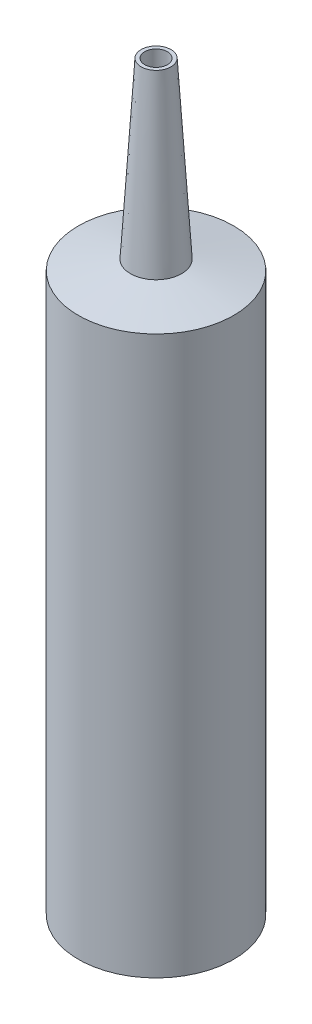
ISO-10303-21;
HEADER;
FILE_DESCRIPTION(('STEP AP214'),'2;1');
FILE_NAME('part.step','',(''),(''),'','','');
FILE_SCHEMA(('AUTOMOTIVE_DESIGN { 1 0 10303 214 1 1 1 1 }'));
ENDSEC;
DATA;
#1=APPLICATION_CONTEXT('core data for automotive mechanical design processes');
#2=APPLICATION_PROTOCOL_DEFINITION('international standard','automotive_design',2000,#1);
#3=PRODUCT_CONTEXT('',#1,'mechanical');
#4=PRODUCT('Part','Part','',(#3));
#5=PRODUCT_RELATED_PRODUCT_CATEGORY('part','',(#4));
#6=PRODUCT_DEFINITION_FORMATION('','',#4);
#7=PRODUCT_DEFINITION_CONTEXT('part definition',#1,'design');
#8=PRODUCT_DEFINITION('design','',#6,#7);
#9=PRODUCT_DEFINITION_SHAPE('','',#8);
#10=(LENGTH_UNIT() NAMED_UNIT(*) SI_UNIT(.MILLI.,.METRE.));
#11=(NAMED_UNIT(*) PLANE_ANGLE_UNIT() SI_UNIT($,.RADIAN.));
#12=(NAMED_UNIT(*) SI_UNIT($,.STERADIAN.) SOLID_ANGLE_UNIT());
#13=UNCERTAINTY_MEASURE_WITH_UNIT(LENGTH_MEASURE(1.E-05),#10,'distance_accuracy_value','');
#14=(GEOMETRIC_REPRESENTATION_CONTEXT(3) GLOBAL_UNCERTAINTY_ASSIGNED_CONTEXT((#13)) GLOBAL_UNIT_ASSIGNED_CONTEXT((#10,
#11,#12)) REPRESENTATION_CONTEXT('',''));
#15=CARTESIAN_POINT('',(0.,0.,0.));
#16=DIRECTION('',(0.,0.,1.));
#17=DIRECTION('',(1.,0.,0.));
#18=AXIS2_PLACEMENT_3D('',#15,#16,#17);
#19=CARTESIAN_POINT('',(4.80000000000029,111.,0.));
#20=DIRECTION('',(0.,-1.,0.));
#21=DIRECTION('',(0.,0.,-1.));
#22=AXIS2_PLACEMENT_3D('',#19,#20,#21);
#23=PLANE('',#22);
#24=CARTESIAN_POINT('',(0.,111.,0.));
#25=DIRECTION('',(0.,-1.,0.));
#26=DIRECTION('',(0.,0.,-1.));
#27=AXIS2_PLACEMENT_3D('',#24,#25,#26);
#28=CIRCLE('',#27,14.5);
#29=CARTESIAN_POINT('',(0.,111.,-14.5));
#30=VERTEX_POINT('',#29);
#31=EDGE_CURVE('E59',#30,#30,#28,.T.);
#32=ORIENTED_EDGE('',*,*,#31,.T.);
#33=EDGE_LOOP('',(#32));
#34=FACE_BOUND('',#33,.T.);
#35=CARTESIAN_POINT('',(0.,111.,0.));
#36=DIRECTION('',(0.,-1.,0.));
#37=DIRECTION('',(0.,0.,-1.));
#38=AXIS2_PLACEMENT_3D('',#35,#36,#37);
#39=CIRCLE('',#38,4.80000000000029);
#40=CARTESIAN_POINT('',(0.,111.,-4.80000000000029));
#41=VERTEX_POINT('',#40);
#42=EDGE_CURVE('E10',#41,#41,#39,.T.);
#43=ORIENTED_EDGE('',*,*,#42,.F.);
#44=EDGE_LOOP('',(#43));
#45=FACE_BOUND('',#44,.T.);
#46=ADVANCED_FACE('F31',(#34,#45),#23,.T.);
#47=CARTESIAN_POINT('',(0.,149.,0.));
#48=DIRECTION('',(0.,-1.,0.));
#49=DIRECTION('',(0.,0.,-1.));
#50=AXIS2_PLACEMENT_3D('',#47,#48,#49);
#51=CONICAL_SURFACE('',#50,2.27604278483335,0.0663225115757814);
#52=ORIENTED_EDGE('',*,*,#42,.T.);
#53=EDGE_LOOP('',(#52));
#54=FACE_BOUND('',#53,.T.);
#55=CARTESIAN_POINT('',(0.,149.,0.));
#56=DIRECTION('',(0.,-1.,0.));
#57=DIRECTION('',(0.,0.,-1.));
#58=AXIS2_PLACEMENT_3D('',#55,#56,#57);
#59=CIRCLE('',#58,2.27604278483335);
#60=CARTESIAN_POINT('',(0.,149.,-2.27604278483335));
#61=VERTEX_POINT('',#60);
#62=EDGE_CURVE('E37',#61,#61,#59,.T.);
#63=ORIENTED_EDGE('',*,*,#62,.F.);
#64=EDGE_LOOP('',(#63));
#65=FACE_BOUND('',#64,.T.);
#66=ADVANCED_FACE('F77',(#54,#65),#51,.F.);
#67=CARTESIAN_POINT('',(2.99999999999971,149.,0.));
#68=DIRECTION('',(0.,1.,0.));
#69=DIRECTION('',(0.,0.,1.));
#70=AXIS2_PLACEMENT_3D('',#67,#68,#69);
#71=PLANE('',#70);
#72=ORIENTED_EDGE('',*,*,#62,.T.);
#73=EDGE_LOOP('',(#72));
#74=FACE_BOUND('',#73,.T.);
#75=CARTESIAN_POINT('',(0.,149.,0.));
#76=DIRECTION('',(0.,-1.,0.));
#77=DIRECTION('',(0.,0.,-1.));
#78=AXIS2_PLACEMENT_3D('',#75,#76,#77);
#79=CIRCLE('',#78,2.99999999999971);
#80=CARTESIAN_POINT('',(0.,149.,-2.99999999999971));
#81=VERTEX_POINT('',#80);
#82=EDGE_CURVE('E41',#81,#81,#79,.T.);
#83=ORIENTED_EDGE('',*,*,#82,.F.);
#84=EDGE_LOOP('',(#83));
#85=FACE_BOUND('',#84,.T.);
#86=ADVANCED_FACE('F81',(#74,#85),#71,.T.);
#87=CARTESIAN_POINT('',(0.,114.070682791616,0.));
#88=DIRECTION('',(0.,-1.,0.));
#89=DIRECTION('',(0.,0.,-1.));
#90=AXIS2_PLACEMENT_3D('',#87,#88,#89);
#91=CONICAL_SURFACE('',#90,5.13636856053176,0.0610865238197983);
#92=ORIENTED_EDGE('',*,*,#82,.T.);
#93=EDGE_LOOP('',(#92));
#94=FACE_BOUND('',#93,.T.);
#95=CARTESIAN_POINT('',(0.,114.070682791616,0.));
#96=DIRECTION('',(0.,-1.,0.));
#97=DIRECTION('',(0.,0.,-1.));
#98=AXIS2_PLACEMENT_3D('',#95,#96,#97);
#99=CIRCLE('',#98,5.13636856053176);
#100=CARTESIAN_POINT('',(0.,114.070682791616,-5.13636856053176));
#101=VERTEX_POINT('',#100);
#102=EDGE_CURVE('E45',#101,#101,#99,.T.);
#103=ORIENTED_EDGE('',*,*,#102,.F.);
#104=EDGE_LOOP('',(#103));
#105=FACE_BOUND('',#104,.T.);
#106=ADVANCED_FACE('F85',(#94,#105),#91,.T.);
#107=CARTESIAN_POINT('',(0.,112.036758877709,0.));
#108=DIRECTION('',(0.,-1.,0.));
#109=DIRECTION('',(0.,0.,-1.));
#110=AXIS2_PLACEMENT_3D('',#107,#108,#109);
#111=CONICAL_SURFACE('',#110,15.6,1.37881010907552);
#112=ORIENTED_EDGE('',*,*,#102,.T.);
#113=EDGE_LOOP('',(#112));
#114=FACE_BOUND('',#113,.T.);
#115=CARTESIAN_POINT('',(0.,112.036758877709,0.));
#116=DIRECTION('',(0.,-1.,0.));
#117=DIRECTION('',(0.,0.,-1.));
#118=AXIS2_PLACEMENT_3D('',#115,#116,#117);
#119=CIRCLE('',#118,15.6);
#120=CARTESIAN_POINT('',(0.,112.036758877709,-15.6));
#121=VERTEX_POINT('',#120);
#122=EDGE_CURVE('E50',#121,#121,#119,.T.);
#123=ORIENTED_EDGE('',*,*,#122,.F.);
#124=EDGE_LOOP('',(#123));
#125=FACE_BOUND('',#124,.T.);
#126=ADVANCED_FACE('F91',(#114,#125),#111,.T.);
#127=CARTESIAN_POINT('',(0.,149.,0.));
#128=DIRECTION('',(0.,-1.,0.));
#129=DIRECTION('',(0.,0.,-1.));
#130=AXIS2_PLACEMENT_3D('',#127,#128,#129);
#131=CYLINDRICAL_SURFACE('',#130,15.6);
#132=ORIENTED_EDGE('',*,*,#122,.T.);
#133=EDGE_LOOP('',(#132));
#134=FACE_BOUND('',#133,.T.);
#135=CARTESIAN_POINT('',(0.,0.,0.));
#136=DIRECTION('',(0.,-1.,0.));
#137=DIRECTION('',(0.,0.,-1.));
#138=AXIS2_PLACEMENT_3D('',#135,#136,#137);
#139=CIRCLE('',#138,15.6);
#140=CARTESIAN_POINT('',(0.,0.,-15.6));
#141=VERTEX_POINT('',#140);
#142=EDGE_CURVE('E53',#141,#141,#139,.T.);
#143=ORIENTED_EDGE('',*,*,#142,.F.);
#144=EDGE_LOOP('',(#143));
#145=FACE_BOUND('',#144,.T.);
#146=ADVANCED_FACE('F73',(#134,#145),#131,.T.);
#147=CARTESIAN_POINT('',(14.5,0.,0.));
#148=DIRECTION('',(0.,-1.,0.));
#149=DIRECTION('',(0.,0.,-1.));
#150=AXIS2_PLACEMENT_3D('',#147,#148,#149);
#151=PLANE('',#150);
#152=ORIENTED_EDGE('',*,*,#142,.T.);
#153=EDGE_LOOP('',(#152));
#154=FACE_BOUND('',#153,.T.);
#155=CARTESIAN_POINT('',(0.,0.,0.));
#156=DIRECTION('',(0.,-1.,0.));
#157=DIRECTION('',(0.,0.,-1.));
#158=AXIS2_PLACEMENT_3D('',#155,#156,#157);
#159=CIRCLE('',#158,14.5);
#160=CARTESIAN_POINT('',(0.,0.,-14.5));
#161=VERTEX_POINT('',#160);
#162=EDGE_CURVE('E56',#161,#161,#159,.T.);
#163=ORIENTED_EDGE('',*,*,#162,.F.);
#164=EDGE_LOOP('',(#163));
#165=FACE_BOUND('',#164,.T.);
#166=ADVANCED_FACE('F67',(#154,#165),#151,.T.);
#167=CARTESIAN_POINT('',(0.,149.,0.));
#168=DIRECTION('',(0.,-1.,0.));
#169=DIRECTION('',(0.,0.,-1.));
#170=AXIS2_PLACEMENT_3D('',#167,#168,#169);
#171=CYLINDRICAL_SURFACE('',#170,14.5);
#172=ORIENTED_EDGE('',*,*,#162,.T.);
#173=EDGE_LOOP('',(#172));
#174=FACE_BOUND('',#173,.T.);
#175=ORIENTED_EDGE('',*,*,#31,.F.);
#176=EDGE_LOOP('',(#175));
#177=FACE_BOUND('',#176,.T.);
#178=ADVANCED_FACE('F65',(#174,#177),#171,.F.);
#179=CLOSED_SHELL('',(#46,#66,#86,#106,#126,#146,#166,#178));
#180=MANIFOLD_SOLID_BREP('B2',#179);
#181=ADVANCED_BREP_SHAPE_REPRESENTATION('',(#18,#180),#14);
#182=SHAPE_DEFINITION_REPRESENTATION(#9,#181);
ENDSEC;
END-ISO-10303-21;
